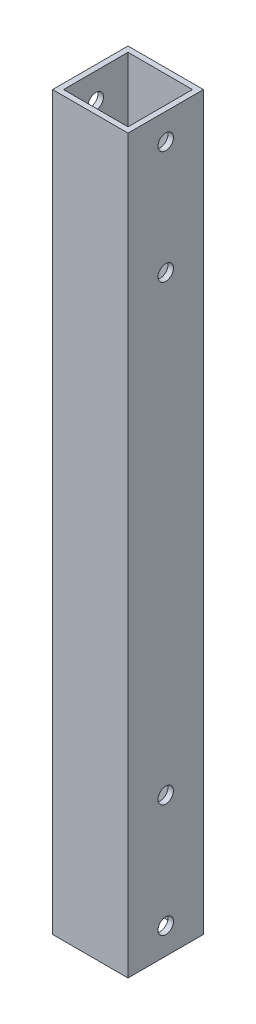
ISO-10303-21;
HEADER;
FILE_DESCRIPTION(('STEP AP214'),'2;1');
FILE_NAME('part.step','',(''),(''),'','','');
FILE_SCHEMA(('AUTOMOTIVE_DESIGN { 1 0 10303 214 1 1 1 1 }'));
ENDSEC;
DATA;
#1=APPLICATION_CONTEXT('core data for automotive mechanical design processes');
#2=APPLICATION_PROTOCOL_DEFINITION('international standard','automotive_design',2000,#1);
#3=PRODUCT_CONTEXT('',#1,'mechanical');
#4=PRODUCT('Part','Part','',(#3));
#5=PRODUCT_RELATED_PRODUCT_CATEGORY('part','',(#4));
#6=PRODUCT_DEFINITION_FORMATION('','',#4);
#7=PRODUCT_DEFINITION_CONTEXT('part definition',#1,'design');
#8=PRODUCT_DEFINITION('design','',#6,#7);
#9=PRODUCT_DEFINITION_SHAPE('','',#8);
#10=(LENGTH_UNIT() NAMED_UNIT(*) SI_UNIT(.MILLI.,.METRE.));
#11=(NAMED_UNIT(*) PLANE_ANGLE_UNIT() SI_UNIT($,.RADIAN.));
#12=(NAMED_UNIT(*) SI_UNIT($,.STERADIAN.) SOLID_ANGLE_UNIT());
#13=UNCERTAINTY_MEASURE_WITH_UNIT(LENGTH_MEASURE(1.E-05),#10,'distance_accuracy_value','');
#14=(GEOMETRIC_REPRESENTATION_CONTEXT(3) GLOBAL_UNCERTAINTY_ASSIGNED_CONTEXT((#13)) GLOBAL_UNIT_ASSIGNED_CONTEXT((#10,
#11,#12)) REPRESENTATION_CONTEXT('',''));
#15=CARTESIAN_POINT('',(0.,0.,0.));
#16=DIRECTION('',(0.,0.,1.));
#17=DIRECTION('',(1.,0.,0.));
#18=AXIS2_PLACEMENT_3D('',#15,#16,#17);
#19=CARTESIAN_POINT('',(0.,194.,0.));
#20=DIRECTION('',(0.,-1.,0.));
#21=DIRECTION('',(0.,0.,-1.));
#22=AXIS2_PLACEMENT_3D('',#19,#20,#21);
#23=PLANE('',#22);
#24=DIRECTION('',(0.,0.,1.));
#25=VECTOR('',#24,1.);
#26=CARTESIAN_POINT('',(0.,194.,0.));
#27=LINE('',#26,#25);
#28=CARTESIAN_POINT('',(0.,194.,-20.));
#29=VERTEX_POINT('',#28);
#30=CARTESIAN_POINT('',(0.,194.,0.));
#31=VERTEX_POINT('',#30);
#32=EDGE_CURVE('E138',#29,#31,#27,.T.);
#33=ORIENTED_EDGE('',*,*,#32,.T.);
#34=DIRECTION('',(1.,0.,0.));
#35=VECTOR('',#34,1.);
#36=CARTESIAN_POINT('',(0.,194.,0.));
#37=LINE('',#36,#35);
#38=CARTESIAN_POINT('',(20.,194.,0.));
#39=VERTEX_POINT('',#38);
#40=EDGE_CURVE('E141',#31,#39,#37,.T.);
#41=ORIENTED_EDGE('',*,*,#40,.T.);
#42=DIRECTION('',(0.,0.,-1.));
#43=VECTOR('',#42,1.);
#44=CARTESIAN_POINT('',(20.,194.,0.));
#45=LINE('',#44,#43);
#46=CARTESIAN_POINT('',(20.,194.,-20.));
#47=VERTEX_POINT('',#46);
#48=EDGE_CURVE('E144',#39,#47,#45,.T.);
#49=ORIENTED_EDGE('',*,*,#48,.T.);
#50=DIRECTION('',(-1.,0.,0.));
#51=VECTOR('',#50,1.);
#52=CARTESIAN_POINT('',(0.,194.,-20.));
#53=LINE('',#52,#51);
#54=EDGE_CURVE('E146',#47,#29,#53,.T.);
#55=ORIENTED_EDGE('',*,*,#54,.T.);
#56=EDGE_LOOP('',(#33,#41,#49,#55));
#57=FACE_BOUND('',#56,.T.);
#58=DIRECTION('',(0.,0.,1.));
#59=VECTOR('',#58,1.);
#60=CARTESIAN_POINT('',(1.45,194.,-1.45));
#61=LINE('',#60,#59);
#62=CARTESIAN_POINT('',(1.45,194.,-18.55));
#63=VERTEX_POINT('',#62);
#64=CARTESIAN_POINT('',(1.45,194.,-1.45));
#65=VERTEX_POINT('',#64);
#66=EDGE_CURVE('E100',#63,#65,#61,.T.);
#67=ORIENTED_EDGE('',*,*,#66,.F.);
#68=DIRECTION('',(-1.,0.,0.));
#69=VECTOR('',#68,1.);
#70=CARTESIAN_POINT('',(1.45,194.,-18.55));
#71=LINE('',#70,#69);
#72=CARTESIAN_POINT('',(18.55,194.,-18.55));
#73=VERTEX_POINT('',#72);
#74=EDGE_CURVE('E122',#73,#63,#71,.T.);
#75=ORIENTED_EDGE('',*,*,#74,.F.);
#76=DIRECTION('',(0.,0.,-1.));
#77=VECTOR('',#76,1.);
#78=CARTESIAN_POINT('',(18.55,194.,-1.45));
#79=LINE('',#78,#77);
#80=CARTESIAN_POINT('',(18.55,194.,-1.45));
#81=VERTEX_POINT('',#80);
#82=EDGE_CURVE('E120',#81,#73,#79,.T.);
#83=ORIENTED_EDGE('',*,*,#82,.F.);
#84=DIRECTION('',(1.,0.,0.));
#85=VECTOR('',#84,1.);
#86=CARTESIAN_POINT('',(1.45,194.,-1.45));
#87=LINE('',#86,#85);
#88=EDGE_CURVE('E108',#65,#81,#87,.T.);
#89=ORIENTED_EDGE('',*,*,#88,.F.);
#90=EDGE_LOOP('',(#67,#75,#83,#89));
#91=FACE_BOUND('',#90,.T.);
#92=ADVANCED_FACE('F33',(#57,#91),#23,.F.);
#93=CARTESIAN_POINT('',(0.,0.,0.));
#94=DIRECTION('',(0.,-1.,0.));
#95=DIRECTION('',(0.,0.,-1.));
#96=AXIS2_PLACEMENT_3D('',#93,#94,#95);
#97=PLANE('',#96);
#98=DIRECTION('',(0.,0.,1.));
#99=VECTOR('',#98,1.);
#100=CARTESIAN_POINT('',(0.,0.,0.));
#101=LINE('',#100,#99);
#102=CARTESIAN_POINT('',(0.,0.,-20.));
#103=VERTEX_POINT('',#102);
#104=CARTESIAN_POINT('',(0.,0.,0.));
#105=VERTEX_POINT('',#104);
#106=EDGE_CURVE('E116',#103,#105,#101,.T.);
#107=ORIENTED_EDGE('',*,*,#106,.F.);
#108=DIRECTION('',(-1.,0.,0.));
#109=VECTOR('',#108,1.);
#110=CARTESIAN_POINT('',(0.,0.,-20.));
#111=LINE('',#110,#109);
#112=CARTESIAN_POINT('',(20.,0.,-20.));
#113=VERTEX_POINT('',#112);
#114=EDGE_CURVE('E142',#113,#103,#111,.T.);
#115=ORIENTED_EDGE('',*,*,#114,.F.);
#116=DIRECTION('',(0.,0.,-1.));
#117=VECTOR('',#116,1.);
#118=CARTESIAN_POINT('',(20.,0.,0.));
#119=LINE('',#118,#117);
#120=CARTESIAN_POINT('',(20.,0.,0.));
#121=VERTEX_POINT('',#120);
#122=EDGE_CURVE('E153',#121,#113,#119,.T.);
#123=ORIENTED_EDGE('',*,*,#122,.F.);
#124=DIRECTION('',(1.,0.,0.));
#125=VECTOR('',#124,1.);
#126=CARTESIAN_POINT('',(0.,0.,0.));
#127=LINE('',#126,#125);
#128=EDGE_CURVE('E151',#105,#121,#127,.T.);
#129=ORIENTED_EDGE('',*,*,#128,.F.);
#130=EDGE_LOOP('',(#107,#115,#123,#129));
#131=FACE_BOUND('',#130,.T.);
#132=DIRECTION('',(-1.,0.,0.));
#133=VECTOR('',#132,1.);
#134=CARTESIAN_POINT('',(1.45,0.,-18.55));
#135=LINE('',#134,#133);
#136=CARTESIAN_POINT('',(18.55,0.,-18.55));
#137=VERTEX_POINT('',#136);
#138=CARTESIAN_POINT('',(1.45,0.,-18.55));
#139=VERTEX_POINT('',#138);
#140=EDGE_CURVE('E109',#137,#139,#135,.T.);
#141=ORIENTED_EDGE('',*,*,#140,.T.);
#142=DIRECTION('',(0.,0.,1.));
#143=VECTOR('',#142,1.);
#144=CARTESIAN_POINT('',(1.45,0.,-1.45));
#145=LINE('',#144,#143);
#146=CARTESIAN_POINT('',(1.45,0.,-1.45));
#147=VERTEX_POINT('',#146);
#148=EDGE_CURVE('E58',#139,#147,#145,.T.);
#149=ORIENTED_EDGE('',*,*,#148,.T.);
#150=DIRECTION('',(1.,0.,0.));
#151=VECTOR('',#150,1.);
#152=CARTESIAN_POINT('',(1.45,0.,-1.45));
#153=LINE('',#152,#151);
#154=CARTESIAN_POINT('',(18.55,0.,-1.45));
#155=VERTEX_POINT('',#154);
#156=EDGE_CURVE('E115',#147,#155,#153,.T.);
#157=ORIENTED_EDGE('',*,*,#156,.T.);
#158=DIRECTION('',(0.,0.,-1.));
#159=VECTOR('',#158,1.);
#160=CARTESIAN_POINT('',(18.55,0.,-1.45));
#161=LINE('',#160,#159);
#162=EDGE_CURVE('E130',#155,#137,#161,.T.);
#163=ORIENTED_EDGE('',*,*,#162,.T.);
#164=EDGE_LOOP('',(#141,#149,#157,#163));
#165=FACE_BOUND('',#164,.T.);
#166=ADVANCED_FACE('F205',(#131,#165),#97,.T.);
#167=CARTESIAN_POINT('',(0.,194.,0.));
#168=DIRECTION('',(1.,0.,0.));
#169=DIRECTION('',(0.,0.,-1.));
#170=AXIS2_PLACEMENT_3D('',#167,#168,#169);
#171=PLANE('',#170);
#172=CARTESIAN_POINT('',(0.,187.,-10.));
#173=DIRECTION('',(-1.,0.,0.));
#174=DIRECTION('',(0.,0.,1.));
#175=AXIS2_PLACEMENT_3D('',#172,#173,#174);
#176=CIRCLE('',#175,2.05000000000003);
#177=CARTESIAN_POINT('',(0.,187.,-7.94999999999997));
#178=VERTEX_POINT('',#177);
#179=EDGE_CURVE('E258',#178,#178,#176,.T.);
#180=ORIENTED_EDGE('',*,*,#179,.F.);
#181=EDGE_LOOP('',(#180));
#182=FACE_BOUND('',#181,.T.);
#183=CARTESIAN_POINT('',(0.,157.,-10.));
#184=DIRECTION('',(-1.,0.,0.));
#185=DIRECTION('',(0.,0.,1.));
#186=AXIS2_PLACEMENT_3D('',#183,#184,#185);
#187=CIRCLE('',#186,2.05000000000002);
#188=CARTESIAN_POINT('',(0.,157.,-7.94999999999998));
#189=VERTEX_POINT('',#188);
#190=EDGE_CURVE('E262',#189,#189,#187,.T.);
#191=ORIENTED_EDGE('',*,*,#190,.F.);
#192=EDGE_LOOP('',(#191));
#193=FACE_BOUND('',#192,.T.);
#194=CARTESIAN_POINT('',(0.,37.,-10.));
#195=DIRECTION('',(-1.,0.,0.));
#196=DIRECTION('',(0.,0.,1.));
#197=AXIS2_PLACEMENT_3D('',#194,#195,#196);
#198=CIRCLE('',#197,2.05000000000002);
#199=CARTESIAN_POINT('',(0.,37.,-7.94999999999998));
#200=VERTEX_POINT('',#199);
#201=EDGE_CURVE('E266',#200,#200,#198,.T.);
#202=ORIENTED_EDGE('',*,*,#201,.F.);
#203=EDGE_LOOP('',(#202));
#204=FACE_BOUND('',#203,.T.);
#205=CARTESIAN_POINT('',(0.,7.,-10.));
#206=DIRECTION('',(-1.,0.,0.));
#207=DIRECTION('',(0.,0.,1.));
#208=AXIS2_PLACEMENT_3D('',#205,#206,#207);
#209=CIRCLE('',#208,2.05000000000001);
#210=CARTESIAN_POINT('',(0.,7.,-7.94999999999999));
#211=VERTEX_POINT('',#210);
#212=EDGE_CURVE('E269',#211,#211,#209,.T.);
#213=ORIENTED_EDGE('',*,*,#212,.F.);
#214=EDGE_LOOP('',(#213));
#215=FACE_BOUND('',#214,.T.);
#216=ORIENTED_EDGE('',*,*,#106,.T.);
#217=DIRECTION('',(0.,-1.,0.));
#218=VECTOR('',#217,1.);
#219=CARTESIAN_POINT('',(0.,194.,0.));
#220=LINE('',#219,#218);
#221=EDGE_CURVE('E11',#31,#105,#220,.T.);
#222=ORIENTED_EDGE('',*,*,#221,.F.);
#223=ORIENTED_EDGE('',*,*,#32,.F.);
#224=DIRECTION('',(0.,-1.,0.));
#225=VECTOR('',#224,1.);
#226=CARTESIAN_POINT('',(0.,194.,-20.));
#227=LINE('',#226,#225);
#228=EDGE_CURVE('E148',#29,#103,#227,.T.);
#229=ORIENTED_EDGE('',*,*,#228,.T.);
#230=EDGE_LOOP('',(#216,#222,#223,#229));
#231=FACE_BOUND('',#230,.T.);
#232=ADVANCED_FACE('F35',(#182,#193,#204,#215,#231),#171,.F.);
#233=CARTESIAN_POINT('',(0.,194.,0.));
#234=DIRECTION('',(0.,0.,-1.));
#235=DIRECTION('',(-1.,0.,0.));
#236=AXIS2_PLACEMENT_3D('',#233,#234,#235);
#237=PLANE('',#236);
#238=ORIENTED_EDGE('',*,*,#128,.T.);
#239=DIRECTION('',(0.,-1.,0.));
#240=VECTOR('',#239,1.);
#241=CARTESIAN_POINT('',(20.,194.,0.));
#242=LINE('',#241,#240);
#243=EDGE_CURVE('E42',#39,#121,#242,.T.);
#244=ORIENTED_EDGE('',*,*,#243,.F.);
#245=ORIENTED_EDGE('',*,*,#40,.F.);
#246=ORIENTED_EDGE('',*,*,#221,.T.);
#247=EDGE_LOOP('',(#238,#244,#245,#246));
#248=FACE_BOUND('',#247,.T.);
#249=ADVANCED_FACE('F233',(#248),#237,.F.);
#250=CARTESIAN_POINT('',(20.,194.,0.));
#251=DIRECTION('',(-1.,0.,0.));
#252=DIRECTION('',(0.,0.,1.));
#253=AXIS2_PLACEMENT_3D('',#250,#251,#252);
#254=PLANE('',#253);
#255=CARTESIAN_POINT('',(20.,187.,-10.));
#256=DIRECTION('',(-1.,0.,0.));
#257=DIRECTION('',(0.,0.,1.));
#258=AXIS2_PLACEMENT_3D('',#255,#256,#257);
#259=CIRCLE('',#258,2.05000000000003);
#260=CARTESIAN_POINT('',(20.,187.,-7.94999999999997));
#261=VERTEX_POINT('',#260);
#262=EDGE_CURVE('E167',#261,#261,#259,.T.);
#263=ORIENTED_EDGE('',*,*,#262,.T.);
#264=EDGE_LOOP('',(#263));
#265=FACE_BOUND('',#264,.T.);
#266=CARTESIAN_POINT('',(20.,157.,-10.));
#267=DIRECTION('',(-1.,0.,0.));
#268=DIRECTION('',(0.,0.,1.));
#269=AXIS2_PLACEMENT_3D('',#266,#267,#268);
#270=CIRCLE('',#269,2.05000000000002);
#271=CARTESIAN_POINT('',(20.,157.,-7.94999999999998));
#272=VERTEX_POINT('',#271);
#273=EDGE_CURVE('E280',#272,#272,#270,.T.);
#274=ORIENTED_EDGE('',*,*,#273,.T.);
#275=EDGE_LOOP('',(#274));
#276=FACE_BOUND('',#275,.T.);
#277=CARTESIAN_POINT('',(20.,37.,-10.));
#278=DIRECTION('',(-1.,0.,0.));
#279=DIRECTION('',(0.,0.,1.));
#280=AXIS2_PLACEMENT_3D('',#277,#278,#279);
#281=CIRCLE('',#280,2.05000000000002);
#282=CARTESIAN_POINT('',(20.,37.,-7.94999999999998));
#283=VERTEX_POINT('',#282);
#284=EDGE_CURVE('E276',#283,#283,#281,.T.);
#285=ORIENTED_EDGE('',*,*,#284,.T.);
#286=EDGE_LOOP('',(#285));
#287=FACE_BOUND('',#286,.T.);
#288=CARTESIAN_POINT('',(20.,7.,-10.));
#289=DIRECTION('',(-1.,0.,0.));
#290=DIRECTION('',(0.,0.,1.));
#291=AXIS2_PLACEMENT_3D('',#288,#289,#290);
#292=CIRCLE('',#291,2.05000000000001);
#293=CARTESIAN_POINT('',(20.,7.,-7.94999999999999));
#294=VERTEX_POINT('',#293);
#295=EDGE_CURVE('E271',#294,#294,#292,.T.);
#296=ORIENTED_EDGE('',*,*,#295,.T.);
#297=EDGE_LOOP('',(#296));
#298=FACE_BOUND('',#297,.T.);
#299=ORIENTED_EDGE('',*,*,#122,.T.);
#300=DIRECTION('',(0.,-1.,0.));
#301=VECTOR('',#300,1.);
#302=CARTESIAN_POINT('',(20.,194.,-20.));
#303=LINE('',#302,#301);
#304=EDGE_CURVE('E158',#47,#113,#303,.T.);
#305=ORIENTED_EDGE('',*,*,#304,.F.);
#306=ORIENTED_EDGE('',*,*,#48,.F.);
#307=ORIENTED_EDGE('',*,*,#243,.T.);
#308=EDGE_LOOP('',(#299,#305,#306,#307));
#309=FACE_BOUND('',#308,.T.);
#310=ADVANCED_FACE('F230',(#265,#276,#287,#298,#309),#254,.F.);
#311=CARTESIAN_POINT('',(0.,194.,-20.));
#312=DIRECTION('',(0.,0.,1.));
#313=DIRECTION('',(1.,0.,0.));
#314=AXIS2_PLACEMENT_3D('',#311,#312,#313);
#315=PLANE('',#314);
#316=ORIENTED_EDGE('',*,*,#114,.T.);
#317=ORIENTED_EDGE('',*,*,#228,.F.);
#318=ORIENTED_EDGE('',*,*,#54,.F.);
#319=ORIENTED_EDGE('',*,*,#304,.T.);
#320=EDGE_LOOP('',(#316,#317,#318,#319));
#321=FACE_BOUND('',#320,.T.);
#322=ADVANCED_FACE('F227',(#321),#315,.F.);
#323=CARTESIAN_POINT('',(1.45,194.,-1.45));
#324=DIRECTION('',(1.,0.,0.));
#325=DIRECTION('',(0.,0.,-1.));
#326=AXIS2_PLACEMENT_3D('',#323,#324,#325);
#327=PLANE('',#326);
#328=CARTESIAN_POINT('',(1.45,187.,-10.));
#329=DIRECTION('',(1.,0.,0.));
#330=DIRECTION('',(0.,0.,-1.));
#331=AXIS2_PLACEMENT_3D('',#328,#329,#330);
#332=CIRCLE('',#331,2.05000000000003);
#333=CARTESIAN_POINT('',(1.45,187.,-12.05));
#334=VERTEX_POINT('',#333);
#335=EDGE_CURVE('E128',#334,#334,#332,.T.);
#336=ORIENTED_EDGE('',*,*,#335,.F.);
#337=EDGE_LOOP('',(#336));
#338=FACE_BOUND('',#337,.T.);
#339=CARTESIAN_POINT('',(1.45,157.,-10.));
#340=DIRECTION('',(1.,0.,0.));
#341=DIRECTION('',(0.,0.,-1.));
#342=AXIS2_PLACEMENT_3D('',#339,#340,#341);
#343=CIRCLE('',#342,2.05000000000002);
#344=CARTESIAN_POINT('',(1.45,157.,-12.05));
#345=VERTEX_POINT('',#344);
#346=EDGE_CURVE('E173',#345,#345,#343,.T.);
#347=ORIENTED_EDGE('',*,*,#346,.F.);
#348=EDGE_LOOP('',(#347));
#349=FACE_BOUND('',#348,.T.);
#350=CARTESIAN_POINT('',(1.45,37.,-10.));
#351=DIRECTION('',(1.,0.,0.));
#352=DIRECTION('',(0.,0.,-1.));
#353=AXIS2_PLACEMENT_3D('',#350,#351,#352);
#354=CIRCLE('',#353,2.05000000000002);
#355=CARTESIAN_POINT('',(1.45,37.,-12.05));
#356=VERTEX_POINT('',#355);
#357=EDGE_CURVE('E170',#356,#356,#354,.T.);
#358=ORIENTED_EDGE('',*,*,#357,.F.);
#359=EDGE_LOOP('',(#358));
#360=FACE_BOUND('',#359,.T.);
#361=CARTESIAN_POINT('',(1.45,7.,-10.));
#362=DIRECTION('',(1.,0.,0.));
#363=DIRECTION('',(0.,0.,-1.));
#364=AXIS2_PLACEMENT_3D('',#361,#362,#363);
#365=CIRCLE('',#364,2.05000000000001);
#366=CARTESIAN_POINT('',(1.45,7.,-12.05));
#367=VERTEX_POINT('',#366);
#368=EDGE_CURVE('E166',#367,#367,#365,.T.);
#369=ORIENTED_EDGE('',*,*,#368,.F.);
#370=EDGE_LOOP('',(#369));
#371=FACE_BOUND('',#370,.T.);
#372=ORIENTED_EDGE('',*,*,#148,.F.);
#373=DIRECTION('',(0.,-1.,0.));
#374=VECTOR('',#373,1.);
#375=CARTESIAN_POINT('',(1.45,194.,-18.55));
#376=LINE('',#375,#374);
#377=EDGE_CURVE('E104',#63,#139,#376,.T.);
#378=ORIENTED_EDGE('',*,*,#377,.F.);
#379=ORIENTED_EDGE('',*,*,#66,.T.);
#380=DIRECTION('',(0.,-1.,0.));
#381=VECTOR('',#380,1.);
#382=CARTESIAN_POINT('',(1.45,194.,-1.45));
#383=LINE('',#382,#381);
#384=EDGE_CURVE('E103',#65,#147,#383,.T.);
#385=ORIENTED_EDGE('',*,*,#384,.T.);
#386=EDGE_LOOP('',(#372,#378,#379,#385));
#387=FACE_BOUND('',#386,.T.);
#388=ADVANCED_FACE('F102',(#338,#349,#360,#371,#387),#327,.T.);
#389=CARTESIAN_POINT('',(1.45,194.,-1.45));
#390=DIRECTION('',(0.,0.,-1.));
#391=DIRECTION('',(-1.,0.,0.));
#392=AXIS2_PLACEMENT_3D('',#389,#390,#391);
#393=PLANE('',#392);
#394=ORIENTED_EDGE('',*,*,#156,.F.);
#395=ORIENTED_EDGE('',*,*,#384,.F.);
#396=ORIENTED_EDGE('',*,*,#88,.T.);
#397=DIRECTION('',(0.,-1.,0.));
#398=VECTOR('',#397,1.);
#399=CARTESIAN_POINT('',(18.55,194.,-1.45));
#400=LINE('',#399,#398);
#401=EDGE_CURVE('E117',#81,#155,#400,.T.);
#402=ORIENTED_EDGE('',*,*,#401,.T.);
#403=EDGE_LOOP('',(#394,#395,#396,#402));
#404=FACE_BOUND('',#403,.T.);
#405=ADVANCED_FACE('F112',(#404),#393,.T.);
#406=CARTESIAN_POINT('',(18.55,194.,-1.45));
#407=DIRECTION('',(-1.,0.,0.));
#408=DIRECTION('',(0.,0.,1.));
#409=AXIS2_PLACEMENT_3D('',#406,#407,#408);
#410=PLANE('',#409);
#411=CARTESIAN_POINT('',(18.55,187.,-10.));
#412=DIRECTION('',(-1.,0.,0.));
#413=DIRECTION('',(0.,0.,1.));
#414=AXIS2_PLACEMENT_3D('',#411,#412,#413);
#415=CIRCLE('',#414,2.05000000000003);
#416=CARTESIAN_POINT('',(18.55,187.,-7.94999999999997));
#417=VERTEX_POINT('',#416);
#418=EDGE_CURVE('E37',#417,#417,#415,.T.);
#419=ORIENTED_EDGE('',*,*,#418,.F.);
#420=EDGE_LOOP('',(#419));
#421=FACE_BOUND('',#420,.T.);
#422=CARTESIAN_POINT('',(18.55,157.,-10.));
#423=DIRECTION('',(-1.,0.,0.));
#424=DIRECTION('',(0.,0.,1.));
#425=AXIS2_PLACEMENT_3D('',#422,#423,#424);
#426=CIRCLE('',#425,2.05000000000002);
#427=CARTESIAN_POINT('',(18.55,157.,-7.94999999999998));
#428=VERTEX_POINT('',#427);
#429=EDGE_CURVE('E171',#428,#428,#426,.T.);
#430=ORIENTED_EDGE('',*,*,#429,.F.);
#431=EDGE_LOOP('',(#430));
#432=FACE_BOUND('',#431,.T.);
#433=CARTESIAN_POINT('',(18.55,37.,-10.));
#434=DIRECTION('',(-1.,0.,0.));
#435=DIRECTION('',(0.,0.,1.));
#436=AXIS2_PLACEMENT_3D('',#433,#434,#435);
#437=CIRCLE('',#436,2.05000000000002);
#438=CARTESIAN_POINT('',(18.55,37.,-7.94999999999998));
#439=VERTEX_POINT('',#438);
#440=EDGE_CURVE('E168',#439,#439,#437,.T.);
#441=ORIENTED_EDGE('',*,*,#440,.F.);
#442=EDGE_LOOP('',(#441));
#443=FACE_BOUND('',#442,.T.);
#444=CARTESIAN_POINT('',(18.55,7.,-10.));
#445=DIRECTION('',(-1.,0.,0.));
#446=DIRECTION('',(0.,0.,1.));
#447=AXIS2_PLACEMENT_3D('',#444,#445,#446);
#448=CIRCLE('',#447,2.05000000000001);
#449=CARTESIAN_POINT('',(18.55,7.,-7.94999999999999));
#450=VERTEX_POINT('',#449);
#451=EDGE_CURVE('E163',#450,#450,#448,.T.);
#452=ORIENTED_EDGE('',*,*,#451,.F.);
#453=EDGE_LOOP('',(#452));
#454=FACE_BOUND('',#453,.T.);
#455=ORIENTED_EDGE('',*,*,#162,.F.);
#456=ORIENTED_EDGE('',*,*,#401,.F.);
#457=ORIENTED_EDGE('',*,*,#82,.T.);
#458=DIRECTION('',(0.,-1.,0.));
#459=VECTOR('',#458,1.);
#460=CARTESIAN_POINT('',(18.55,194.,-18.55));
#461=LINE('',#460,#459);
#462=EDGE_CURVE('E50',#73,#137,#461,.T.);
#463=ORIENTED_EDGE('',*,*,#462,.T.);
#464=EDGE_LOOP('',(#455,#456,#457,#463));
#465=FACE_BOUND('',#464,.T.);
#466=ADVANCED_FACE('F193',(#421,#432,#443,#454,#465),#410,.T.);
#467=CARTESIAN_POINT('',(1.45,194.,-18.55));
#468=DIRECTION('',(0.,0.,1.));
#469=DIRECTION('',(1.,0.,0.));
#470=AXIS2_PLACEMENT_3D('',#467,#468,#469);
#471=PLANE('',#470);
#472=ORIENTED_EDGE('',*,*,#140,.F.);
#473=ORIENTED_EDGE('',*,*,#462,.F.);
#474=ORIENTED_EDGE('',*,*,#74,.T.);
#475=ORIENTED_EDGE('',*,*,#377,.T.);
#476=EDGE_LOOP('',(#472,#473,#474,#475));
#477=FACE_BOUND('',#476,.T.);
#478=ADVANCED_FACE('F196',(#477),#471,.T.);
#479=CARTESIAN_POINT('',(20.,7.,-10.));
#480=DIRECTION('',(-1.,0.,0.));
#481=DIRECTION('',(0.,0.,1.));
#482=AXIS2_PLACEMENT_3D('',#479,#480,#481);
#483=CYLINDRICAL_SURFACE('',#482,2.05000000000001);
#484=ORIENTED_EDGE('',*,*,#451,.T.);
#485=EDGE_LOOP('',(#484));
#486=FACE_BOUND('',#485,.T.);
#487=ORIENTED_EDGE('',*,*,#295,.F.);
#488=EDGE_LOOP('',(#487));
#489=FACE_BOUND('',#488,.T.);
#490=ADVANCED_FACE('F207',(#486,#489),#483,.F.);
#491=CARTESIAN_POINT('',(20.,37.,-10.));
#492=DIRECTION('',(-1.,0.,0.));
#493=DIRECTION('',(0.,0.,1.));
#494=AXIS2_PLACEMENT_3D('',#491,#492,#493);
#495=CYLINDRICAL_SURFACE('',#494,2.05000000000002);
#496=ORIENTED_EDGE('',*,*,#440,.T.);
#497=EDGE_LOOP('',(#496));
#498=FACE_BOUND('',#497,.T.);
#499=ORIENTED_EDGE('',*,*,#284,.F.);
#500=EDGE_LOOP('',(#499));
#501=FACE_BOUND('',#500,.T.);
#502=ADVANCED_FACE('F212',(#498,#501),#495,.F.);
#503=CARTESIAN_POINT('',(20.,157.,-10.));
#504=DIRECTION('',(-1.,0.,0.));
#505=DIRECTION('',(0.,0.,1.));
#506=AXIS2_PLACEMENT_3D('',#503,#504,#505);
#507=CYLINDRICAL_SURFACE('',#506,2.05000000000002);
#508=ORIENTED_EDGE('',*,*,#429,.T.);
#509=EDGE_LOOP('',(#508));
#510=FACE_BOUND('',#509,.T.);
#511=ORIENTED_EDGE('',*,*,#273,.F.);
#512=EDGE_LOOP('',(#511));
#513=FACE_BOUND('',#512,.T.);
#514=ADVANCED_FACE('F288',(#510,#513),#507,.F.);
#515=CARTESIAN_POINT('',(20.,187.,-10.));
#516=DIRECTION('',(-1.,0.,0.));
#517=DIRECTION('',(0.,0.,1.));
#518=AXIS2_PLACEMENT_3D('',#515,#516,#517);
#519=CYLINDRICAL_SURFACE('',#518,2.05000000000003);
#520=ORIENTED_EDGE('',*,*,#418,.T.);
#521=EDGE_LOOP('',(#520));
#522=FACE_BOUND('',#521,.T.);
#523=ORIENTED_EDGE('',*,*,#262,.F.);
#524=EDGE_LOOP('',(#523));
#525=FACE_BOUND('',#524,.T.);
#526=ADVANCED_FACE('F190',(#522,#525),#519,.F.);
#527=ORIENTED_EDGE('',*,*,#368,.T.);
#528=EDGE_LOOP('',(#527));
#529=FACE_BOUND('',#528,.T.);
#530=ORIENTED_EDGE('',*,*,#212,.T.);
#531=EDGE_LOOP('',(#530));
#532=FACE_BOUND('',#531,.T.);
#533=ADVANCED_FACE('F215',(#529,#532),#483,.F.);
#534=ORIENTED_EDGE('',*,*,#357,.T.);
#535=EDGE_LOOP('',(#534));
#536=FACE_BOUND('',#535,.T.);
#537=ORIENTED_EDGE('',*,*,#201,.T.);
#538=EDGE_LOOP('',(#537));
#539=FACE_BOUND('',#538,.T.);
#540=ADVANCED_FACE('F295',(#536,#539),#495,.F.);
#541=ORIENTED_EDGE('',*,*,#346,.T.);
#542=EDGE_LOOP('',(#541));
#543=FACE_BOUND('',#542,.T.);
#544=ORIENTED_EDGE('',*,*,#190,.T.);
#545=EDGE_LOOP('',(#544));
#546=FACE_BOUND('',#545,.T.);
#547=ADVANCED_FACE('F298',(#543,#546),#507,.F.);
#548=ORIENTED_EDGE('',*,*,#335,.T.);
#549=EDGE_LOOP('',(#548));
#550=FACE_BOUND('',#549,.T.);
#551=ORIENTED_EDGE('',*,*,#179,.T.);
#552=EDGE_LOOP('',(#551));
#553=FACE_BOUND('',#552,.T.);
#554=ADVANCED_FACE('F290',(#550,#553),#519,.F.);
#555=CLOSED_SHELL('',(#92,#166,#232,#249,#310,#322,#388,#405,#466,#478,#490,#502,#514,#526,#533,
#540,#547,#554));
#556=MANIFOLD_SOLID_BREP('B2',#555);
#557=ADVANCED_BREP_SHAPE_REPRESENTATION('',(#18,#556),#14);
#558=SHAPE_DEFINITION_REPRESENTATION(#9,#557);
ENDSEC;
END-ISO-10303-21;
